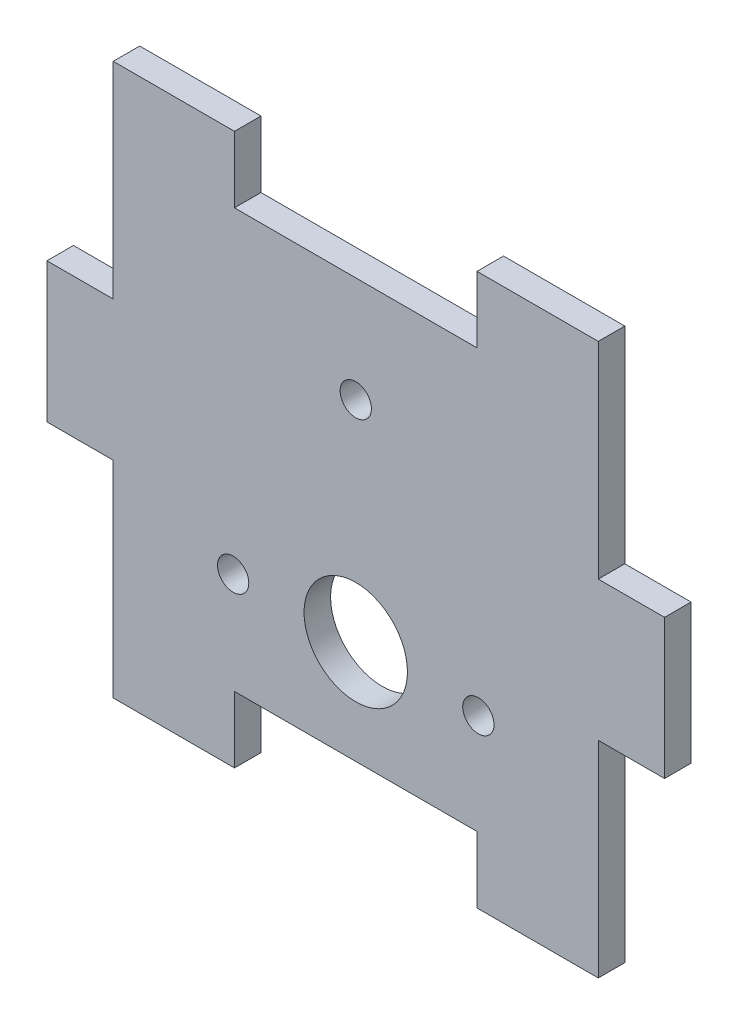
ISO-10303-21;
HEADER;
FILE_DESCRIPTION(('STEP AP214'),'2;1');
FILE_NAME('part.step','',(''),(''),'','','');
FILE_SCHEMA(('AUTOMOTIVE_DESIGN { 1 0 10303 214 1 1 1 1 }'));
ENDSEC;
DATA;
#1=APPLICATION_CONTEXT('core data for automotive mechanical design processes');
#2=APPLICATION_PROTOCOL_DEFINITION('international standard','automotive_design',2000,#1);
#3=PRODUCT_CONTEXT('',#1,'mechanical');
#4=PRODUCT('Part','Part','',(#3));
#5=PRODUCT_RELATED_PRODUCT_CATEGORY('part','',(#4));
#6=PRODUCT_DEFINITION_FORMATION('','',#4);
#7=PRODUCT_DEFINITION_CONTEXT('part definition',#1,'design');
#8=PRODUCT_DEFINITION('design','',#6,#7);
#9=PRODUCT_DEFINITION_SHAPE('','',#8);
#10=(LENGTH_UNIT() NAMED_UNIT(*) SI_UNIT(.MILLI.,.METRE.));
#11=(NAMED_UNIT(*) PLANE_ANGLE_UNIT() SI_UNIT($,.RADIAN.));
#12=(NAMED_UNIT(*) SI_UNIT($,.STERADIAN.) SOLID_ANGLE_UNIT());
#13=UNCERTAINTY_MEASURE_WITH_UNIT(LENGTH_MEASURE(1.E-05),#10,'distance_accuracy_value','');
#14=(GEOMETRIC_REPRESENTATION_CONTEXT(3) GLOBAL_UNCERTAINTY_ASSIGNED_CONTEXT((#13)) GLOBAL_UNIT_ASSIGNED_CONTEXT((#10,
#11,#12)) REPRESENTATION_CONTEXT('',''));
#15=CARTESIAN_POINT('',(0.,0.,0.));
#16=DIRECTION('',(0.,0.,1.));
#17=DIRECTION('',(1.,0.,0.));
#18=AXIS2_PLACEMENT_3D('',#15,#16,#17);
#19=CARTESIAN_POINT('',(-23.241,-20.066,1.27));
#20=DIRECTION('',(0.,1.,0.));
#21=DIRECTION('',(0.,0.,1.));
#22=AXIS2_PLACEMENT_3D('',#19,#20,#21);
#23=PLANE('',#22);
#24=DIRECTION('',(1.,0.,0.));
#25=VECTOR('',#24,1.);
#26=CARTESIAN_POINT('',(-23.241,-20.066,-1.27));
#27=LINE('',#26,#25);
#28=CARTESIAN_POINT('',(-11.6205,-20.066,-1.27));
#29=VERTEX_POINT('',#28);
#30=CARTESIAN_POINT('',(11.6205,-20.066,-1.27));
#31=VERTEX_POINT('',#30);
#32=EDGE_CURVE('E55',#29,#31,#27,.T.);
#33=ORIENTED_EDGE('',*,*,#32,.T.);
#34=DIRECTION('',(0.,0.,1.));
#35=VECTOR('',#34,1.);
#36=CARTESIAN_POINT('',(11.6205,-20.066,-1.27));
#37=LINE('',#36,#35);
#38=CARTESIAN_POINT('',(11.6205,-20.066,1.27));
#39=VERTEX_POINT('',#38);
#40=EDGE_CURVE('E51',#31,#39,#37,.T.);
#41=ORIENTED_EDGE('',*,*,#40,.T.);
#42=DIRECTION('',(1.,0.,0.));
#43=VECTOR('',#42,1.);
#44=CARTESIAN_POINT('',(-23.241,-20.066,1.27));
#45=LINE('',#44,#43);
#46=CARTESIAN_POINT('',(-11.6205,-20.066,1.27));
#47=VERTEX_POINT('',#46);
#48=EDGE_CURVE('E11',#47,#39,#45,.T.);
#49=ORIENTED_EDGE('',*,*,#48,.F.);
#50=DIRECTION('',(0.,0.,1.));
#51=VECTOR('',#50,1.);
#52=CARTESIAN_POINT('',(-11.6205,-20.066,-1.27));
#53=LINE('',#52,#51);
#54=EDGE_CURVE('E215',#29,#47,#53,.T.);
#55=ORIENTED_EDGE('',*,*,#54,.F.);
#56=EDGE_LOOP('',(#33,#41,#49,#55));
#57=FACE_BOUND('',#56,.T.);
#58=ADVANCED_FACE('F34',(#57),#23,.F.);
#59=CARTESIAN_POINT('',(23.241,-20.066,1.27));
#60=DIRECTION('',(-1.,0.,0.));
#61=DIRECTION('',(0.,0.,1.));
#62=AXIS2_PLACEMENT_3D('',#59,#60,#61);
#63=PLANE('',#62);
#64=DIRECTION('',(0.,0.,1.));
#65=VECTOR('',#64,1.);
#66=CARTESIAN_POINT('',(23.241,6.68866666666667,-1.27));
#67=LINE('',#66,#65);
#68=CARTESIAN_POINT('',(23.241,6.68866666666667,-1.27));
#69=VERTEX_POINT('',#68);
#70=CARTESIAN_POINT('',(23.241,6.68866666666667,1.27));
#71=VERTEX_POINT('',#70);
#72=EDGE_CURVE('E321',#69,#71,#67,.T.);
#73=ORIENTED_EDGE('',*,*,#72,.F.);
#74=DIRECTION('',(0.,1.,0.));
#75=VECTOR('',#74,1.);
#76=CARTESIAN_POINT('',(23.241,-20.066,-1.27));
#77=LINE('',#76,#75);
#78=CARTESIAN_POINT('',(23.241,26.416,-1.27));
#79=VERTEX_POINT('',#78);
#80=EDGE_CURVE('E275',#69,#79,#77,.T.);
#81=ORIENTED_EDGE('',*,*,#80,.T.);
#82=DIRECTION('',(0.,0.,1.));
#83=VECTOR('',#82,1.);
#84=CARTESIAN_POINT('',(23.241,26.416,-1.27));
#85=LINE('',#84,#83);
#86=CARTESIAN_POINT('',(23.241,26.416,1.27));
#87=VERTEX_POINT('',#86);
#88=EDGE_CURVE('E392',#79,#87,#85,.T.);
#89=ORIENTED_EDGE('',*,*,#88,.T.);
#90=DIRECTION('',(0.,1.,0.));
#91=VECTOR('',#90,1.);
#92=CARTESIAN_POINT('',(23.241,-20.066,1.27));
#93=LINE('',#92,#91);
#94=EDGE_CURVE('E268',#71,#87,#93,.T.);
#95=ORIENTED_EDGE('',*,*,#94,.F.);
#96=EDGE_LOOP('',(#73,#81,#89,#95));
#97=FACE_BOUND('',#96,.T.);
#98=ADVANCED_FACE('F451',(#97),#63,.F.);
#99=CARTESIAN_POINT('',(-23.241,-20.066,1.27));
#100=DIRECTION('',(1.,0.,0.));
#101=DIRECTION('',(0.,0.,-1.));
#102=AXIS2_PLACEMENT_3D('',#99,#100,#101);
#103=PLANE('',#102);
#104=DIRECTION('',(0.,0.,1.));
#105=VECTOR('',#104,1.);
#106=CARTESIAN_POINT('',(-23.241,-6.68866666666667,-1.27));
#107=LINE('',#106,#105);
#108=CARTESIAN_POINT('',(-23.241,-6.68866666666667,-1.27));
#109=VERTEX_POINT('',#108);
#110=CARTESIAN_POINT('',(-23.241,-6.68866666666667,1.27));
#111=VERTEX_POINT('',#110);
#112=EDGE_CURVE('E396',#109,#111,#107,.T.);
#113=ORIENTED_EDGE('',*,*,#112,.F.);
#114=DIRECTION('',(0.,-1.,0.));
#115=VECTOR('',#114,1.);
#116=CARTESIAN_POINT('',(-23.241,-20.066,-1.27));
#117=LINE('',#116,#115);
#118=CARTESIAN_POINT('',(-23.241,-26.416,-1.27));
#119=VERTEX_POINT('',#118);
#120=EDGE_CURVE('E297',#109,#119,#117,.T.);
#121=ORIENTED_EDGE('',*,*,#120,.T.);
#122=DIRECTION('',(0.,0.,1.));
#123=VECTOR('',#122,1.);
#124=CARTESIAN_POINT('',(-23.241,-26.416,-1.27));
#125=LINE('',#124,#123);
#126=CARTESIAN_POINT('',(-23.241,-26.416,1.27));
#127=VERTEX_POINT('',#126);
#128=EDGE_CURVE('E227',#119,#127,#125,.T.);
#129=ORIENTED_EDGE('',*,*,#128,.T.);
#130=DIRECTION('',(0.,-1.,0.));
#131=VECTOR('',#130,1.);
#132=CARTESIAN_POINT('',(-23.241,-20.066,1.27));
#133=LINE('',#132,#131);
#134=EDGE_CURVE('E270',#111,#127,#133,.T.);
#135=ORIENTED_EDGE('',*,*,#134,.F.);
#136=EDGE_LOOP('',(#113,#121,#129,#135));
#137=FACE_BOUND('',#136,.T.);
#138=ADVANCED_FACE('F478',(#137),#103,.F.);
#139=CARTESIAN_POINT('',(23.241,-26.416,-1.27));
#140=VERTEX_POINT('',#139);
#141=CARTESIAN_POINT('',(23.241,-6.68866666666667,-1.27));
#142=VERTEX_POINT('',#141);
#143=EDGE_CURVE('E191',#140,#142,#77,.T.);
#144=ORIENTED_EDGE('',*,*,#143,.T.);
#145=DIRECTION('',(0.,0.,1.));
#146=VECTOR('',#145,1.);
#147=CARTESIAN_POINT('',(23.241,-6.68866666666667,-1.27));
#148=LINE('',#147,#146);
#149=CARTESIAN_POINT('',(23.241,-6.68866666666667,1.27));
#150=VERTEX_POINT('',#149);
#151=EDGE_CURVE('E319',#142,#150,#148,.T.);
#152=ORIENTED_EDGE('',*,*,#151,.T.);
#153=CARTESIAN_POINT('',(23.241,-26.416,1.27));
#154=VERTEX_POINT('',#153);
#155=EDGE_CURVE('E263',#154,#150,#93,.T.);
#156=ORIENTED_EDGE('',*,*,#155,.F.);
#157=DIRECTION('',(0.,0.,1.));
#158=VECTOR('',#157,1.);
#159=CARTESIAN_POINT('',(23.241,-26.416,-1.27));
#160=LINE('',#159,#158);
#161=EDGE_CURVE('E181',#140,#154,#160,.T.);
#162=ORIENTED_EDGE('',*,*,#161,.F.);
#163=EDGE_LOOP('',(#144,#152,#156,#162));
#164=FACE_BOUND('',#163,.T.);
#165=ADVANCED_FACE('F36',(#164),#63,.F.);
#166=CARTESIAN_POINT('',(-23.241,20.066,1.27));
#167=DIRECTION('',(0.,-1.,0.));
#168=DIRECTION('',(0.,0.,-1.));
#169=AXIS2_PLACEMENT_3D('',#166,#167,#168);
#170=PLANE('',#169);
#171=DIRECTION('',(-1.,0.,0.));
#172=VECTOR('',#171,1.);
#173=CARTESIAN_POINT('',(-23.241,20.066,1.27));
#174=LINE('',#173,#172);
#175=CARTESIAN_POINT('',(11.6205,20.066,1.27));
#176=VERTEX_POINT('',#175);
#177=CARTESIAN_POINT('',(-11.6205,20.066,1.27));
#178=VERTEX_POINT('',#177);
#179=EDGE_CURVE('E267',#176,#178,#174,.T.);
#180=ORIENTED_EDGE('',*,*,#179,.F.);
#181=DIRECTION('',(0.,0.,1.));
#182=VECTOR('',#181,1.);
#183=CARTESIAN_POINT('',(11.6205,20.066,-1.27));
#184=LINE('',#183,#182);
#185=CARTESIAN_POINT('',(11.6205,20.066,-1.27));
#186=VERTEX_POINT('',#185);
#187=EDGE_CURVE('E399',#186,#176,#184,.T.);
#188=ORIENTED_EDGE('',*,*,#187,.F.);
#189=DIRECTION('',(-1.,0.,0.));
#190=VECTOR('',#189,1.);
#191=CARTESIAN_POINT('',(-23.241,20.066,-1.27));
#192=LINE('',#191,#190);
#193=CARTESIAN_POINT('',(-11.6205,20.066,-1.27));
#194=VERTEX_POINT('',#193);
#195=EDGE_CURVE('E290',#186,#194,#192,.T.);
#196=ORIENTED_EDGE('',*,*,#195,.T.);
#197=DIRECTION('',(0.,0.,1.));
#198=VECTOR('',#197,1.);
#199=CARTESIAN_POINT('',(-11.6205,20.066,-1.27));
#200=LINE('',#199,#198);
#201=EDGE_CURVE('E409',#194,#178,#200,.T.);
#202=ORIENTED_EDGE('',*,*,#201,.T.);
#203=EDGE_LOOP('',(#180,#188,#196,#202));
#204=FACE_BOUND('',#203,.T.);
#205=ADVANCED_FACE('F438',(#204),#170,.F.);
#206=CARTESIAN_POINT('',(-23.241,26.416,-1.27));
#207=VERTEX_POINT('',#206);
#208=CARTESIAN_POINT('',(-23.241,6.68866666666667,-1.27));
#209=VERTEX_POINT('',#208);
#210=EDGE_CURVE('E293',#207,#209,#117,.T.);
#211=ORIENTED_EDGE('',*,*,#210,.T.);
#212=DIRECTION('',(0.,0.,1.));
#213=VECTOR('',#212,1.);
#214=CARTESIAN_POINT('',(-23.241,6.68866666666667,-1.27));
#215=LINE('',#214,#213);
#216=CARTESIAN_POINT('',(-23.241,6.68866666666667,1.27));
#217=VERTEX_POINT('',#216);
#218=EDGE_CURVE('E373',#209,#217,#215,.T.);
#219=ORIENTED_EDGE('',*,*,#218,.T.);
#220=CARTESIAN_POINT('',(-23.241,26.416,1.27));
#221=VERTEX_POINT('',#220);
#222=EDGE_CURVE('E43',#221,#217,#133,.T.);
#223=ORIENTED_EDGE('',*,*,#222,.F.);
#224=DIRECTION('',(0.,0.,1.));
#225=VECTOR('',#224,1.);
#226=CARTESIAN_POINT('',(-23.241,26.416,-1.27));
#227=LINE('',#226,#225);
#228=EDGE_CURVE('E414',#207,#221,#227,.T.);
#229=ORIENTED_EDGE('',*,*,#228,.F.);
#230=EDGE_LOOP('',(#211,#219,#223,#229));
#231=FACE_BOUND('',#230,.T.);
#232=ADVANCED_FACE('F258',(#231),#103,.F.);
#233=CARTESIAN_POINT('',(23.241,20.066,1.27));
#234=DIRECTION('',(0.,0.,-1.));
#235=DIRECTION('',(-1.,0.,0.));
#236=AXIS2_PLACEMENT_3D('',#233,#234,#235);
#237=PLANE('',#236);
#238=CARTESIAN_POINT('',(11.75,-10.3975969889342,1.27));
#239=DIRECTION('',(0.,0.,1.));
#240=DIRECTION('',(1.,0.,0.));
#241=AXIS2_PLACEMENT_3D('',#238,#239,#240);
#242=CIRCLE('',#241,1.50000000000001);
#243=CARTESIAN_POINT('',(13.25,-10.3975969889342,1.27));
#244=VERTEX_POINT('',#243);
#245=EDGE_CURVE('E248',#244,#244,#242,.T.);
#246=ORIENTED_EDGE('',*,*,#245,.F.);
#247=EDGE_LOOP('',(#246));
#248=FACE_BOUND('',#247,.T.);
#249=CARTESIAN_POINT('',(-11.75,-10.3975969889342,1.27));
#250=DIRECTION('',(0.,0.,1.));
#251=DIRECTION('',(1.,0.,0.));
#252=AXIS2_PLACEMENT_3D('',#249,#250,#251);
#253=CIRCLE('',#252,1.50000000000001);
#254=CARTESIAN_POINT('',(-10.25,-10.3975969889342,1.27));
#255=VERTEX_POINT('',#254);
#256=EDGE_CURVE('E238',#255,#255,#253,.T.);
#257=ORIENTED_EDGE('',*,*,#256,.F.);
#258=EDGE_LOOP('',(#257));
#259=FACE_BOUND('',#258,.T.);
#260=CARTESIAN_POINT('',(0.,-10.16,1.27));
#261=DIRECTION('',(0.,0.,1.));
#262=DIRECTION('',(1.,0.,0.));
#263=AXIS2_PLACEMENT_3D('',#260,#261,#262);
#264=CIRCLE('',#263,4.95300000000001);
#265=CARTESIAN_POINT('',(4.95299999999996,-10.16,1.27));
#266=VERTEX_POINT('',#265);
#267=EDGE_CURVE('E235',#266,#266,#264,.T.);
#268=ORIENTED_EDGE('',*,*,#267,.F.);
#269=EDGE_LOOP('',(#268));
#270=FACE_BOUND('',#269,.T.);
#271=CARTESIAN_POINT('',(0.,9.95400000000008,1.27));
#272=DIRECTION('',(0.,0.,1.));
#273=DIRECTION('',(1.,0.,0.));
#274=AXIS2_PLACEMENT_3D('',#271,#272,#273);
#275=CIRCLE('',#274,1.50000000000001);
#276=CARTESIAN_POINT('',(1.49999999999994,9.95400000000008,1.27));
#277=VERTEX_POINT('',#276);
#278=EDGE_CURVE('E232',#277,#277,#275,.T.);
#279=ORIENTED_EDGE('',*,*,#278,.F.);
#280=EDGE_LOOP('',(#279));
#281=FACE_BOUND('',#280,.T.);
#282=ORIENTED_EDGE('',*,*,#155,.T.);
#283=DIRECTION('',(1.,0.,0.));
#284=VECTOR('',#283,1.);
#285=CARTESIAN_POINT('',(23.241,-6.68866666666667,1.27));
#286=LINE('',#285,#284);
#287=CARTESIAN_POINT('',(29.591,-6.68866666666667,1.27));
#288=VERTEX_POINT('',#287);
#289=EDGE_CURVE('E218',#150,#288,#286,.T.);
#290=ORIENTED_EDGE('',*,*,#289,.T.);
#291=DIRECTION('',(0.,1.,0.));
#292=VECTOR('',#291,1.);
#293=CARTESIAN_POINT('',(29.591,-6.68866666666667,1.27));
#294=LINE('',#293,#292);
#295=CARTESIAN_POINT('',(29.591,6.68866666666667,1.27));
#296=VERTEX_POINT('',#295);
#297=EDGE_CURVE('E314',#288,#296,#294,.T.);
#298=ORIENTED_EDGE('',*,*,#297,.T.);
#299=DIRECTION('',(-1.,0.,0.));
#300=VECTOR('',#299,1.);
#301=CARTESIAN_POINT('',(23.241,6.68866666666667,1.27));
#302=LINE('',#301,#300);
#303=EDGE_CURVE('E310',#296,#71,#302,.T.);
#304=ORIENTED_EDGE('',*,*,#303,.T.);
#305=ORIENTED_EDGE('',*,*,#94,.T.);
#306=DIRECTION('',(-1.,0.,0.));
#307=VECTOR('',#306,1.);
#308=CARTESIAN_POINT('',(23.241,26.416,1.27));
#309=LINE('',#308,#307);
#310=CARTESIAN_POINT('',(11.6205,26.416,1.27));
#311=VERTEX_POINT('',#310);
#312=EDGE_CURVE('E393',#87,#311,#309,.T.);
#313=ORIENTED_EDGE('',*,*,#312,.T.);
#314=DIRECTION('',(0.,-1.,0.));
#315=VECTOR('',#314,1.);
#316=CARTESIAN_POINT('',(11.6205,20.066,1.27));
#317=LINE('',#316,#315);
#318=EDGE_CURVE('E389',#311,#176,#317,.T.);
#319=ORIENTED_EDGE('',*,*,#318,.T.);
#320=ORIENTED_EDGE('',*,*,#179,.T.);
#321=DIRECTION('',(0.,1.,0.));
#322=VECTOR('',#321,1.);
#323=CARTESIAN_POINT('',(-11.6205,20.066,1.27));
#324=LINE('',#323,#322);
#325=CARTESIAN_POINT('',(-11.6205,26.416,1.27));
#326=VERTEX_POINT('',#325);
#327=EDGE_CURVE('E305',#178,#326,#324,.T.);
#328=ORIENTED_EDGE('',*,*,#327,.T.);
#329=DIRECTION('',(-1.,0.,0.));
#330=VECTOR('',#329,1.);
#331=CARTESIAN_POINT('',(-23.241,26.416,1.27));
#332=LINE('',#331,#330);
#333=EDGE_CURVE('E411',#326,#221,#332,.T.);
#334=ORIENTED_EDGE('',*,*,#333,.T.);
#335=ORIENTED_EDGE('',*,*,#222,.T.);
#336=DIRECTION('',(-1.,0.,0.));
#337=VECTOR('',#336,1.);
#338=CARTESIAN_POINT('',(-23.241,6.68866666666667,1.27));
#339=LINE('',#338,#337);
#340=CARTESIAN_POINT('',(-29.591,6.68866666666667,1.27));
#341=VERTEX_POINT('',#340);
#342=EDGE_CURVE('E324',#217,#341,#339,.T.);
#343=ORIENTED_EDGE('',*,*,#342,.T.);
#344=DIRECTION('',(0.,-1.,0.));
#345=VECTOR('',#344,1.);
#346=CARTESIAN_POINT('',(-29.591,6.68866666666667,1.27));
#347=LINE('',#346,#345);
#348=CARTESIAN_POINT('',(-29.591,-6.68866666666667,1.27));
#349=VERTEX_POINT('',#348);
#350=EDGE_CURVE('E370',#341,#349,#347,.T.);
#351=ORIENTED_EDGE('',*,*,#350,.T.);
#352=DIRECTION('',(1.,0.,0.));
#353=VECTOR('',#352,1.);
#354=CARTESIAN_POINT('',(-23.241,-6.68866666666667,1.27));
#355=LINE('',#354,#353);
#356=EDGE_CURVE('E363',#349,#111,#355,.T.);
#357=ORIENTED_EDGE('',*,*,#356,.T.);
#358=ORIENTED_EDGE('',*,*,#134,.T.);
#359=DIRECTION('',(1.,0.,0.));
#360=VECTOR('',#359,1.);
#361=CARTESIAN_POINT('',(-23.241,-26.416,1.27));
#362=LINE('',#361,#360);
#363=CARTESIAN_POINT('',(-11.6205,-26.416,1.27));
#364=VERTEX_POINT('',#363);
#365=EDGE_CURVE('E201',#127,#364,#362,.T.);
#366=ORIENTED_EDGE('',*,*,#365,.T.);
#367=DIRECTION('',(0.,1.,0.));
#368=VECTOR('',#367,1.);
#369=CARTESIAN_POINT('',(-11.6205,-20.066,1.27));
#370=LINE('',#369,#368);
#371=EDGE_CURVE('E207',#364,#47,#370,.T.);
#372=ORIENTED_EDGE('',*,*,#371,.T.);
#373=ORIENTED_EDGE('',*,*,#48,.T.);
#374=DIRECTION('',(0.,-1.,0.));
#375=VECTOR('',#374,1.);
#376=CARTESIAN_POINT('',(11.6205,-20.066,1.27));
#377=LINE('',#376,#375);
#378=CARTESIAN_POINT('',(11.6205,-26.416,1.27));
#379=VERTEX_POINT('',#378);
#380=EDGE_CURVE('E197',#39,#379,#377,.T.);
#381=ORIENTED_EDGE('',*,*,#380,.T.);
#382=DIRECTION('',(1.,0.,0.));
#383=VECTOR('',#382,1.);
#384=CARTESIAN_POINT('',(23.241,-26.416,1.27));
#385=LINE('',#384,#383);
#386=EDGE_CURVE('E177',#379,#154,#385,.T.);
#387=ORIENTED_EDGE('',*,*,#386,.T.);
#388=EDGE_LOOP('',(#282,#290,#298,#304,#305,#313,#319,#320,#328,#334,#335,#343,#351,#357,#358,
#366,#372,#373,#381,#387));
#389=FACE_BOUND('',#388,.T.);
#390=ADVANCED_FACE('F255',(#248,#259,#270,#281,#389),#237,.F.);
#391=CARTESIAN_POINT('',(23.241,20.066,-1.27));
#392=DIRECTION('',(0.,0.,-1.));
#393=DIRECTION('',(-1.,0.,0.));
#394=AXIS2_PLACEMENT_3D('',#391,#392,#393);
#395=PLANE('',#394);
#396=CARTESIAN_POINT('',(11.75,-10.3975969889342,-1.27));
#397=DIRECTION('',(0.,0.,-1.));
#398=DIRECTION('',(-1.,0.,0.));
#399=AXIS2_PLACEMENT_3D('',#396,#397,#398);
#400=CIRCLE('',#399,1.50000000000001);
#401=CARTESIAN_POINT('',(10.2499999999999,-10.3975969889342,-1.27));
#402=VERTEX_POINT('',#401);
#403=EDGE_CURVE('E38',#402,#402,#400,.T.);
#404=ORIENTED_EDGE('',*,*,#403,.F.);
#405=EDGE_LOOP('',(#404));
#406=FACE_BOUND('',#405,.T.);
#407=CARTESIAN_POINT('',(-11.75,-10.3975969889342,-1.27));
#408=DIRECTION('',(0.,0.,-1.));
#409=DIRECTION('',(-1.,0.,0.));
#410=AXIS2_PLACEMENT_3D('',#407,#408,#409);
#411=CIRCLE('',#410,1.50000000000001);
#412=CARTESIAN_POINT('',(-13.2500000000001,-10.3975969889342,-1.27));
#413=VERTEX_POINT('',#412);
#414=EDGE_CURVE('E236',#413,#413,#411,.T.);
#415=ORIENTED_EDGE('',*,*,#414,.F.);
#416=EDGE_LOOP('',(#415));
#417=FACE_BOUND('',#416,.T.);
#418=CARTESIAN_POINT('',(0.,-10.16,-1.27));
#419=DIRECTION('',(0.,0.,-1.));
#420=DIRECTION('',(-1.,0.,0.));
#421=AXIS2_PLACEMENT_3D('',#418,#419,#420);
#422=CIRCLE('',#421,4.95300000000001);
#423=CARTESIAN_POINT('',(-4.95300000000006,-10.16,-1.27));
#424=VERTEX_POINT('',#423);
#425=EDGE_CURVE('E233',#424,#424,#422,.T.);
#426=ORIENTED_EDGE('',*,*,#425,.F.);
#427=EDGE_LOOP('',(#426));
#428=FACE_BOUND('',#427,.T.);
#429=CARTESIAN_POINT('',(0.,9.95400000000008,-1.27));
#430=DIRECTION('',(0.,0.,-1.));
#431=DIRECTION('',(-1.,0.,0.));
#432=AXIS2_PLACEMENT_3D('',#429,#430,#431);
#433=CIRCLE('',#432,1.50000000000001);
#434=CARTESIAN_POINT('',(-1.50000000000008,9.95400000000008,-1.27));
#435=VERTEX_POINT('',#434);
#436=EDGE_CURVE('E199',#435,#435,#433,.T.);
#437=ORIENTED_EDGE('',*,*,#436,.F.);
#438=EDGE_LOOP('',(#437));
#439=FACE_BOUND('',#438,.T.);
#440=ORIENTED_EDGE('',*,*,#143,.F.);
#441=DIRECTION('',(1.,0.,0.));
#442=VECTOR('',#441,1.);
#443=CARTESIAN_POINT('',(23.241,-26.416,-1.27));
#444=LINE('',#443,#442);
#445=CARTESIAN_POINT('',(11.6205,-26.416,-1.27));
#446=VERTEX_POINT('',#445);
#447=EDGE_CURVE('E175',#446,#140,#444,.T.);
#448=ORIENTED_EDGE('',*,*,#447,.F.);
#449=DIRECTION('',(0.,-1.,0.));
#450=VECTOR('',#449,1.);
#451=CARTESIAN_POINT('',(11.6205,-20.066,-1.27));
#452=LINE('',#451,#450);
#453=EDGE_CURVE('E184',#31,#446,#452,.T.);
#454=ORIENTED_EDGE('',*,*,#453,.F.);
#455=ORIENTED_EDGE('',*,*,#32,.F.);
#456=DIRECTION('',(0.,1.,0.));
#457=VECTOR('',#456,1.);
#458=CARTESIAN_POINT('',(-11.6205,-20.066,-1.27));
#459=LINE('',#458,#457);
#460=CARTESIAN_POINT('',(-11.6205,-26.416,-1.27));
#461=VERTEX_POINT('',#460);
#462=EDGE_CURVE('E206',#461,#29,#459,.T.);
#463=ORIENTED_EDGE('',*,*,#462,.F.);
#464=DIRECTION('',(1.,0.,0.));
#465=VECTOR('',#464,1.);
#466=CARTESIAN_POINT('',(-23.241,-26.416,-1.27));
#467=LINE('',#466,#465);
#468=EDGE_CURVE('E203',#119,#461,#467,.T.);
#469=ORIENTED_EDGE('',*,*,#468,.F.);
#470=ORIENTED_EDGE('',*,*,#120,.F.);
#471=DIRECTION('',(1.,0.,0.));
#472=VECTOR('',#471,1.);
#473=CARTESIAN_POINT('',(-23.241,-6.68866666666667,-1.27));
#474=LINE('',#473,#472);
#475=CARTESIAN_POINT('',(-29.591,-6.68866666666667,-1.27));
#476=VERTEX_POINT('',#475);
#477=EDGE_CURVE('E378',#476,#109,#474,.T.);
#478=ORIENTED_EDGE('',*,*,#477,.F.);
#479=DIRECTION('',(0.,-1.,0.));
#480=VECTOR('',#479,1.);
#481=CARTESIAN_POINT('',(-29.591,6.68866666666667,-1.27));
#482=LINE('',#481,#480);
#483=CARTESIAN_POINT('',(-29.591,6.68866666666667,-1.27));
#484=VERTEX_POINT('',#483);
#485=EDGE_CURVE('E337',#484,#476,#482,.T.);
#486=ORIENTED_EDGE('',*,*,#485,.F.);
#487=DIRECTION('',(-1.,0.,0.));
#488=VECTOR('',#487,1.);
#489=CARTESIAN_POINT('',(-23.241,6.68866666666667,-1.27));
#490=LINE('',#489,#488);
#491=EDGE_CURVE('E379',#209,#484,#490,.T.);
#492=ORIENTED_EDGE('',*,*,#491,.F.);
#493=ORIENTED_EDGE('',*,*,#210,.F.);
#494=DIRECTION('',(-1.,0.,0.));
#495=VECTOR('',#494,1.);
#496=CARTESIAN_POINT('',(-23.241,26.416,-1.27));
#497=LINE('',#496,#495);
#498=CARTESIAN_POINT('',(-11.6205,26.416,-1.27));
#499=VERTEX_POINT('',#498);
#500=EDGE_CURVE('E406',#499,#207,#497,.T.);
#501=ORIENTED_EDGE('',*,*,#500,.F.);
#502=DIRECTION('',(0.,1.,0.));
#503=VECTOR('',#502,1.);
#504=CARTESIAN_POINT('',(-11.6205,20.066,-1.27));
#505=LINE('',#504,#503);
#506=EDGE_CURVE('E410',#194,#499,#505,.T.);
#507=ORIENTED_EDGE('',*,*,#506,.F.);
#508=ORIENTED_EDGE('',*,*,#195,.F.);
#509=DIRECTION('',(0.,-1.,0.));
#510=VECTOR('',#509,1.);
#511=CARTESIAN_POINT('',(11.6205,20.066,-1.27));
#512=LINE('',#511,#510);
#513=CARTESIAN_POINT('',(11.6205,26.416,-1.27));
#514=VERTEX_POINT('',#513);
#515=EDGE_CURVE('E388',#514,#186,#512,.T.);
#516=ORIENTED_EDGE('',*,*,#515,.F.);
#517=DIRECTION('',(-1.,0.,0.));
#518=VECTOR('',#517,1.);
#519=CARTESIAN_POINT('',(23.241,26.416,-1.27));
#520=LINE('',#519,#518);
#521=EDGE_CURVE('E385',#79,#514,#520,.T.);
#522=ORIENTED_EDGE('',*,*,#521,.F.);
#523=ORIENTED_EDGE('',*,*,#80,.F.);
#524=DIRECTION('',(-1.,0.,0.));
#525=VECTOR('',#524,1.);
#526=CARTESIAN_POINT('',(23.241,6.68866666666667,-1.27));
#527=LINE('',#526,#525);
#528=CARTESIAN_POINT('',(29.591,6.68866666666667,-1.27));
#529=VERTEX_POINT('',#528);
#530=EDGE_CURVE('E317',#529,#69,#527,.T.);
#531=ORIENTED_EDGE('',*,*,#530,.F.);
#532=DIRECTION('',(0.,1.,0.));
#533=VECTOR('',#532,1.);
#534=CARTESIAN_POINT('',(29.591,-6.68866666666667,-1.27));
#535=LINE('',#534,#533);
#536=CARTESIAN_POINT('',(29.591,-6.68866666666667,-1.27));
#537=VERTEX_POINT('',#536);
#538=EDGE_CURVE('E320',#537,#529,#535,.T.);
#539=ORIENTED_EDGE('',*,*,#538,.F.);
#540=DIRECTION('',(1.,0.,0.));
#541=VECTOR('',#540,1.);
#542=CARTESIAN_POINT('',(23.241,-6.68866666666667,-1.27));
#543=LINE('',#542,#541);
#544=EDGE_CURVE('E313',#142,#537,#543,.T.);
#545=ORIENTED_EDGE('',*,*,#544,.F.);
#546=EDGE_LOOP('',(#440,#448,#454,#455,#463,#469,#470,#478,#486,#492,#493,#501,#507,#508,#516,
#522,#523,#531,#539,#545));
#547=FACE_BOUND('',#546,.T.);
#548=ADVANCED_FACE('F188',(#406,#417,#428,#439,#547),#395,.T.);
#549=CARTESIAN_POINT('',(-23.241,26.416,-1.27));
#550=DIRECTION('',(0.,1.,0.));
#551=DIRECTION('',(0.,0.,1.));
#552=AXIS2_PLACEMENT_3D('',#549,#550,#551);
#553=PLANE('',#552);
#554=ORIENTED_EDGE('',*,*,#333,.F.);
#555=DIRECTION('',(0.,0.,1.));
#556=VECTOR('',#555,1.);
#557=CARTESIAN_POINT('',(-11.6205,26.416,-1.27));
#558=LINE('',#557,#556);
#559=EDGE_CURVE('E416',#499,#326,#558,.T.);
#560=ORIENTED_EDGE('',*,*,#559,.F.);
#561=ORIENTED_EDGE('',*,*,#500,.T.);
#562=ORIENTED_EDGE('',*,*,#228,.T.);
#563=EDGE_LOOP('',(#554,#560,#561,#562));
#564=FACE_BOUND('',#563,.T.);
#565=ADVANCED_FACE('F435',(#564),#553,.T.);
#566=CARTESIAN_POINT('',(-11.6205,20.066,-1.27));
#567=DIRECTION('',(1.,0.,0.));
#568=DIRECTION('',(0.,0.,-1.));
#569=AXIS2_PLACEMENT_3D('',#566,#567,#568);
#570=PLANE('',#569);
#571=ORIENTED_EDGE('',*,*,#327,.F.);
#572=ORIENTED_EDGE('',*,*,#201,.F.);
#573=ORIENTED_EDGE('',*,*,#506,.T.);
#574=ORIENTED_EDGE('',*,*,#559,.T.);
#575=EDGE_LOOP('',(#571,#572,#573,#574));
#576=FACE_BOUND('',#575,.T.);
#577=ADVANCED_FACE('F430',(#576),#570,.T.);
#578=CARTESIAN_POINT('',(11.6205,20.066,-1.27));
#579=DIRECTION('',(-1.,0.,0.));
#580=DIRECTION('',(0.,0.,1.));
#581=AXIS2_PLACEMENT_3D('',#578,#579,#580);
#582=PLANE('',#581);
#583=ORIENTED_EDGE('',*,*,#318,.F.);
#584=DIRECTION('',(0.,0.,1.));
#585=VECTOR('',#584,1.);
#586=CARTESIAN_POINT('',(11.6205,26.416,-1.27));
#587=LINE('',#586,#585);
#588=EDGE_CURVE('E402',#514,#311,#587,.T.);
#589=ORIENTED_EDGE('',*,*,#588,.F.);
#590=ORIENTED_EDGE('',*,*,#515,.T.);
#591=ORIENTED_EDGE('',*,*,#187,.T.);
#592=EDGE_LOOP('',(#583,#589,#590,#591));
#593=FACE_BOUND('',#592,.T.);
#594=ADVANCED_FACE('F440',(#593),#582,.T.);
#595=CARTESIAN_POINT('',(23.241,26.416,-1.27));
#596=DIRECTION('',(0.,1.,0.));
#597=DIRECTION('',(0.,0.,1.));
#598=AXIS2_PLACEMENT_3D('',#595,#596,#597);
#599=PLANE('',#598);
#600=ORIENTED_EDGE('',*,*,#312,.F.);
#601=ORIENTED_EDGE('',*,*,#88,.F.);
#602=ORIENTED_EDGE('',*,*,#521,.T.);
#603=ORIENTED_EDGE('',*,*,#588,.T.);
#604=EDGE_LOOP('',(#600,#601,#602,#603));
#605=FACE_BOUND('',#604,.T.);
#606=ADVANCED_FACE('F447',(#605),#599,.T.);
#607=CARTESIAN_POINT('',(-23.241,-6.68866666666667,-1.27));
#608=DIRECTION('',(0.,-1.,0.));
#609=DIRECTION('',(1.,0.,0.));
#610=AXIS2_PLACEMENT_3D('',#607,#608,#609);
#611=PLANE('',#610);
#612=ORIENTED_EDGE('',*,*,#356,.F.);
#613=DIRECTION('',(0.,0.,1.));
#614=VECTOR('',#613,1.);
#615=CARTESIAN_POINT('',(-29.591,-6.68866666666667,-1.27));
#616=LINE('',#615,#614);
#617=EDGE_CURVE('E463',#476,#349,#616,.T.);
#618=ORIENTED_EDGE('',*,*,#617,.F.);
#619=ORIENTED_EDGE('',*,*,#477,.T.);
#620=ORIENTED_EDGE('',*,*,#112,.T.);
#621=EDGE_LOOP('',(#612,#618,#619,#620));
#622=FACE_BOUND('',#621,.T.);
#623=ADVANCED_FACE('F475',(#622),#611,.T.);
#624=CARTESIAN_POINT('',(-29.591,6.68866666666667,-1.27));
#625=DIRECTION('',(-1.,0.,0.));
#626=DIRECTION('',(0.,0.,1.));
#627=AXIS2_PLACEMENT_3D('',#624,#625,#626);
#628=PLANE('',#627);
#629=ORIENTED_EDGE('',*,*,#350,.F.);
#630=DIRECTION('',(0.,0.,1.));
#631=VECTOR('',#630,1.);
#632=CARTESIAN_POINT('',(-29.591,6.68866666666667,-1.27));
#633=LINE('',#632,#631);
#634=EDGE_CURVE('E377',#484,#341,#633,.T.);
#635=ORIENTED_EDGE('',*,*,#634,.F.);
#636=ORIENTED_EDGE('',*,*,#485,.T.);
#637=ORIENTED_EDGE('',*,*,#617,.T.);
#638=EDGE_LOOP('',(#629,#635,#636,#637));
#639=FACE_BOUND('',#638,.T.);
#640=ADVANCED_FACE('F473',(#639),#628,.T.);
#641=CARTESIAN_POINT('',(-23.241,6.68866666666667,-1.27));
#642=DIRECTION('',(0.,1.,0.));
#643=DIRECTION('',(0.,0.,1.));
#644=AXIS2_PLACEMENT_3D('',#641,#642,#643);
#645=PLANE('',#644);
#646=ORIENTED_EDGE('',*,*,#342,.F.);
#647=ORIENTED_EDGE('',*,*,#218,.F.);
#648=ORIENTED_EDGE('',*,*,#491,.T.);
#649=ORIENTED_EDGE('',*,*,#634,.T.);
#650=EDGE_LOOP('',(#646,#647,#648,#649));
#651=FACE_BOUND('',#650,.T.);
#652=ADVANCED_FACE('F471',(#651),#645,.T.);
#653=CARTESIAN_POINT('',(23.241,6.68866666666667,-1.27));
#654=DIRECTION('',(0.,1.,0.));
#655=DIRECTION('',(-1.,0.,0.));
#656=AXIS2_PLACEMENT_3D('',#653,#654,#655);
#657=PLANE('',#656);
#658=ORIENTED_EDGE('',*,*,#303,.F.);
#659=DIRECTION('',(0.,0.,1.));
#660=VECTOR('',#659,1.);
#661=CARTESIAN_POINT('',(29.591,6.68866666666667,-1.27));
#662=LINE('',#661,#660);
#663=EDGE_CURVE('E325',#529,#296,#662,.T.);
#664=ORIENTED_EDGE('',*,*,#663,.F.);
#665=ORIENTED_EDGE('',*,*,#530,.T.);
#666=ORIENTED_EDGE('',*,*,#72,.T.);
#667=EDGE_LOOP('',(#658,#664,#665,#666));
#668=FACE_BOUND('',#667,.T.);
#669=ADVANCED_FACE('F505',(#668),#657,.T.);
#670=CARTESIAN_POINT('',(29.591,-6.68866666666667,-1.27));
#671=DIRECTION('',(1.,0.,0.));
#672=DIRECTION('',(0.,0.,-1.));
#673=AXIS2_PLACEMENT_3D('',#670,#671,#672);
#674=PLANE('',#673);
#675=ORIENTED_EDGE('',*,*,#297,.F.);
#676=DIRECTION('',(0.,0.,1.));
#677=VECTOR('',#676,1.);
#678=CARTESIAN_POINT('',(29.591,-6.68866666666667,-1.27));
#679=LINE('',#678,#677);
#680=EDGE_CURVE('E333',#537,#288,#679,.T.);
#681=ORIENTED_EDGE('',*,*,#680,.F.);
#682=ORIENTED_EDGE('',*,*,#538,.T.);
#683=ORIENTED_EDGE('',*,*,#663,.T.);
#684=EDGE_LOOP('',(#675,#681,#682,#683));
#685=FACE_BOUND('',#684,.T.);
#686=ADVANCED_FACE('F513',(#685),#674,.T.);
#687=CARTESIAN_POINT('',(23.241,-6.68866666666667,-1.27));
#688=DIRECTION('',(0.,-1.,0.));
#689=DIRECTION('',(0.,0.,-1.));
#690=AXIS2_PLACEMENT_3D('',#687,#688,#689);
#691=PLANE('',#690);
#692=ORIENTED_EDGE('',*,*,#289,.F.);
#693=ORIENTED_EDGE('',*,*,#151,.F.);
#694=ORIENTED_EDGE('',*,*,#544,.T.);
#695=ORIENTED_EDGE('',*,*,#680,.T.);
#696=EDGE_LOOP('',(#692,#693,#694,#695));
#697=FACE_BOUND('',#696,.T.);
#698=ADVANCED_FACE('F510',(#697),#691,.T.);
#699=CARTESIAN_POINT('',(-11.6205,-20.066,-1.27));
#700=DIRECTION('',(1.,0.,0.));
#701=DIRECTION('',(0.,0.,-1.));
#702=AXIS2_PLACEMENT_3D('',#699,#700,#701);
#703=PLANE('',#702);
#704=ORIENTED_EDGE('',*,*,#371,.F.);
#705=DIRECTION('',(0.,0.,1.));
#706=VECTOR('',#705,1.);
#707=CARTESIAN_POINT('',(-11.6205,-26.416,-1.27));
#708=LINE('',#707,#706);
#709=EDGE_CURVE('E212',#461,#364,#708,.T.);
#710=ORIENTED_EDGE('',*,*,#709,.F.);
#711=ORIENTED_EDGE('',*,*,#462,.T.);
#712=ORIENTED_EDGE('',*,*,#54,.T.);
#713=EDGE_LOOP('',(#704,#710,#711,#712));
#714=FACE_BOUND('',#713,.T.);
#715=ADVANCED_FACE('F359',(#714),#703,.T.);
#716=CARTESIAN_POINT('',(-23.241,-26.416,-1.27));
#717=DIRECTION('',(0.,-1.,0.));
#718=DIRECTION('',(0.,0.,-1.));
#719=AXIS2_PLACEMENT_3D('',#716,#717,#718);
#720=PLANE('',#719);
#721=ORIENTED_EDGE('',*,*,#365,.F.);
#722=ORIENTED_EDGE('',*,*,#128,.F.);
#723=ORIENTED_EDGE('',*,*,#468,.T.);
#724=ORIENTED_EDGE('',*,*,#709,.T.);
#725=EDGE_LOOP('',(#721,#722,#723,#724));
#726=FACE_BOUND('',#725,.T.);
#727=ADVANCED_FACE('F355',(#726),#720,.T.);
#728=CARTESIAN_POINT('',(23.241,-26.416,-1.27));
#729=DIRECTION('',(0.,-1.,0.));
#730=DIRECTION('',(0.,0.,-1.));
#731=AXIS2_PLACEMENT_3D('',#728,#729,#730);
#732=PLANE('',#731);
#733=ORIENTED_EDGE('',*,*,#386,.F.);
#734=DIRECTION('',(0.,0.,1.));
#735=VECTOR('',#734,1.);
#736=CARTESIAN_POINT('',(11.6205,-26.416,-1.27));
#737=LINE('',#736,#735);
#738=EDGE_CURVE('E170',#446,#379,#737,.T.);
#739=ORIENTED_EDGE('',*,*,#738,.F.);
#740=ORIENTED_EDGE('',*,*,#447,.T.);
#741=ORIENTED_EDGE('',*,*,#161,.T.);
#742=EDGE_LOOP('',(#733,#739,#740,#741));
#743=FACE_BOUND('',#742,.T.);
#744=ADVANCED_FACE('F172',(#743),#732,.T.);
#745=CARTESIAN_POINT('',(11.6205,-20.066,-1.27));
#746=DIRECTION('',(-1.,0.,0.));
#747=DIRECTION('',(0.,0.,1.));
#748=AXIS2_PLACEMENT_3D('',#745,#746,#747);
#749=PLANE('',#748);
#750=ORIENTED_EDGE('',*,*,#380,.F.);
#751=ORIENTED_EDGE('',*,*,#40,.F.);
#752=ORIENTED_EDGE('',*,*,#453,.T.);
#753=ORIENTED_EDGE('',*,*,#738,.T.);
#754=EDGE_LOOP('',(#750,#751,#752,#753));
#755=FACE_BOUND('',#754,.T.);
#756=ADVANCED_FACE('F185',(#755),#749,.T.);
#757=CARTESIAN_POINT('',(0.,9.95400000000008,-1.27005));
#758=DIRECTION('',(0.,0.,1.));
#759=DIRECTION('',(1.,0.,0.));
#760=AXIS2_PLACEMENT_3D('',#757,#758,#759);
#761=CYLINDRICAL_SURFACE('',#760,1.50000000000001);
#762=ORIENTED_EDGE('',*,*,#436,.T.);
#763=EDGE_LOOP('',(#762));
#764=FACE_BOUND('',#763,.T.);
#765=ORIENTED_EDGE('',*,*,#278,.T.);
#766=EDGE_LOOP('',(#765));
#767=FACE_BOUND('',#766,.T.);
#768=ADVANCED_FACE('F253',(#764,#767),#761,.F.);
#769=CARTESIAN_POINT('',(0.,-10.16,-1.27005));
#770=DIRECTION('',(0.,0.,1.));
#771=DIRECTION('',(1.,0.,0.));
#772=AXIS2_PLACEMENT_3D('',#769,#770,#771);
#773=CYLINDRICAL_SURFACE('',#772,4.95300000000001);
#774=ORIENTED_EDGE('',*,*,#425,.T.);
#775=EDGE_LOOP('',(#774));
#776=FACE_BOUND('',#775,.T.);
#777=ORIENTED_EDGE('',*,*,#267,.T.);
#778=EDGE_LOOP('',(#777));
#779=FACE_BOUND('',#778,.T.);
#780=ADVANCED_FACE('F529',(#776,#779),#773,.F.);
#781=CARTESIAN_POINT('',(-11.75,-10.3975969889342,-1.27005));
#782=DIRECTION('',(0.,0.,1.));
#783=DIRECTION('',(1.,0.,0.));
#784=AXIS2_PLACEMENT_3D('',#781,#782,#783);
#785=CYLINDRICAL_SURFACE('',#784,1.50000000000001);
#786=ORIENTED_EDGE('',*,*,#414,.T.);
#787=EDGE_LOOP('',(#786));
#788=FACE_BOUND('',#787,.T.);
#789=ORIENTED_EDGE('',*,*,#256,.T.);
#790=EDGE_LOOP('',(#789));
#791=FACE_BOUND('',#790,.T.);
#792=ADVANCED_FACE('F533',(#788,#791),#785,.F.);
#793=CARTESIAN_POINT('',(11.75,-10.3975969889342,-1.27005));
#794=DIRECTION('',(0.,0.,1.));
#795=DIRECTION('',(1.,0.,0.));
#796=AXIS2_PLACEMENT_3D('',#793,#794,#795);
#797=CYLINDRICAL_SURFACE('',#796,1.50000000000001);
#798=ORIENTED_EDGE('',*,*,#403,.T.);
#799=EDGE_LOOP('',(#798));
#800=FACE_BOUND('',#799,.T.);
#801=ORIENTED_EDGE('',*,*,#245,.T.);
#802=EDGE_LOOP('',(#801));
#803=FACE_BOUND('',#802,.T.);
#804=ADVANCED_FACE('F537',(#800,#803),#797,.F.);
#805=CLOSED_SHELL('',(#58,#98,#138,#165,#205,#232,#390,#548,#565,#577,#594,#606,#623,#640,#652,
#669,#686,#698,#715,#727,#744,#756,#768,#780,#792,#804));
#806=MANIFOLD_SOLID_BREP('B2',#805);
#807=ADVANCED_BREP_SHAPE_REPRESENTATION('',(#18,#806),#14);
#808=SHAPE_DEFINITION_REPRESENTATION(#9,#807);
ENDSEC;
END-ISO-10303-21;
